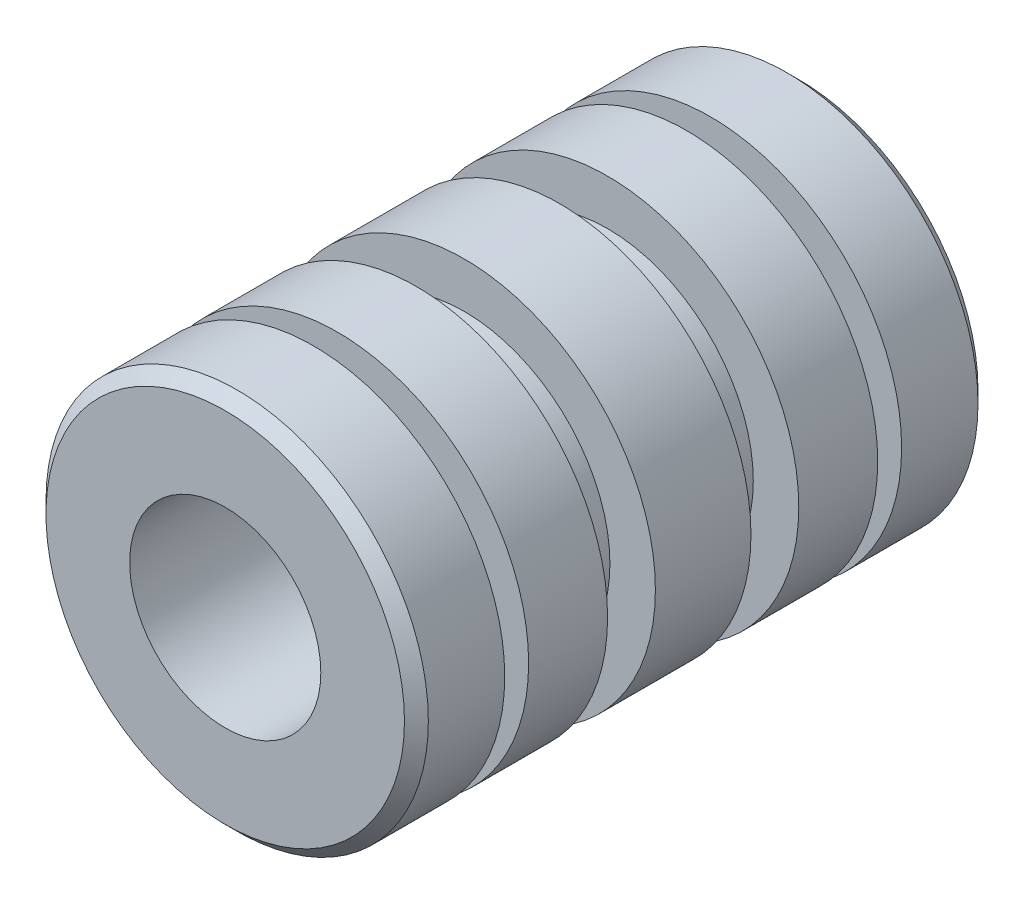
ISO-10303-21;
HEADER;
FILE_DESCRIPTION(('STEP AP214'),'2;1');
FILE_NAME('part.step','',(''),(''),'','','');
FILE_SCHEMA(('AUTOMOTIVE_DESIGN { 1 0 10303 214 1 1 1 1 }'));
ENDSEC;
DATA;
#1=APPLICATION_CONTEXT('core data for automotive mechanical design processes');
#2=APPLICATION_PROTOCOL_DEFINITION('international standard','automotive_design',2000,#1);
#3=PRODUCT_CONTEXT('',#1,'mechanical');
#4=PRODUCT('Part','Part','',(#3));
#5=PRODUCT_RELATED_PRODUCT_CATEGORY('part','',(#4));
#6=PRODUCT_DEFINITION_FORMATION('','',#4);
#7=PRODUCT_DEFINITION_CONTEXT('part definition',#1,'design');
#8=PRODUCT_DEFINITION('design','',#6,#7);
#9=PRODUCT_DEFINITION_SHAPE('','',#8);
#10=(LENGTH_UNIT() NAMED_UNIT(*) SI_UNIT(.MILLI.,.METRE.));
#11=(NAMED_UNIT(*) PLANE_ANGLE_UNIT() SI_UNIT($,.RADIAN.));
#12=(NAMED_UNIT(*) SI_UNIT($,.STERADIAN.) SOLID_ANGLE_UNIT());
#13=UNCERTAINTY_MEASURE_WITH_UNIT(LENGTH_MEASURE(1.E-05),#10,'distance_accuracy_value','');
#14=(GEOMETRIC_REPRESENTATION_CONTEXT(3) GLOBAL_UNCERTAINTY_ASSIGNED_CONTEXT((#13)) GLOBAL_UNIT_ASSIGNED_CONTEXT((#10,
#11,#12)) REPRESENTATION_CONTEXT('',''));
#15=CARTESIAN_POINT('',(0.,0.,0.));
#16=DIRECTION('',(0.,0.,1.));
#17=DIRECTION('',(1.,0.,0.));
#18=AXIS2_PLACEMENT_3D('',#15,#16,#17);
#19=CARTESIAN_POINT('',(0.,0.,19.05));
#20=DIRECTION('',(0.,0.,-1.));
#21=DIRECTION('',(-1.,0.,0.));
#22=AXIS2_PLACEMENT_3D('',#19,#20,#21);
#23=CYLINDRICAL_SURFACE('',#22,6.35);
#24=CARTESIAN_POINT('',(0.,0.,7.9375));
#25=DIRECTION('',(0.,0.,1.));
#26=DIRECTION('',(1.,0.,0.));
#27=AXIS2_PLACEMENT_3D('',#24,#25,#26);
#28=CIRCLE('',#27,6.35);
#29=CARTESIAN_POINT('',(6.35,0.,7.9375));
#30=VERTEX_POINT('',#29);
#31=EDGE_CURVE('E37',#30,#30,#28,.T.);
#32=ORIENTED_EDGE('',*,*,#31,.T.);
#33=EDGE_LOOP('',(#32));
#34=FACE_BOUND('',#33,.T.);
#35=CARTESIAN_POINT('',(0.,0.,11.1125));
#36=DIRECTION('',(0.,0.,-1.));
#37=DIRECTION('',(-1.,0.,0.));
#38=AXIS2_PLACEMENT_3D('',#35,#36,#37);
#39=CIRCLE('',#38,6.35);
#40=CARTESIAN_POINT('',(-6.35,0.,11.1125));
#41=VERTEX_POINT('',#40);
#42=EDGE_CURVE('E53',#41,#41,#39,.T.);
#43=ORIENTED_EDGE('',*,*,#42,.T.);
#44=EDGE_LOOP('',(#43));
#45=FACE_BOUND('',#44,.T.);
#46=ADVANCED_FACE('F33',(#34,#45),#23,.T.);
#47=CARTESIAN_POINT('',(0.,0.,6.35));
#48=DIRECTION('',(0.,0.,-1.));
#49=DIRECTION('',(-1.,0.,0.));
#50=AXIS2_PLACEMENT_3D('',#47,#48,#49);
#51=CIRCLE('',#50,6.35);
#52=CARTESIAN_POINT('',(-6.35,0.,6.35));
#53=VERTEX_POINT('',#52);
#54=EDGE_CURVE('E57',#53,#53,#51,.T.);
#55=ORIENTED_EDGE('',*,*,#54,.T.);
#56=EDGE_LOOP('',(#55));
#57=FACE_BOUND('',#56,.T.);
#58=CARTESIAN_POINT('',(0.,0.,3.72745));
#59=DIRECTION('',(0.,0.,1.));
#60=DIRECTION('',(1.,0.,0.));
#61=AXIS2_PLACEMENT_3D('',#58,#59,#60);
#62=CIRCLE('',#61,6.35);
#63=CARTESIAN_POINT('',(6.35,0.,3.72745));
#64=VERTEX_POINT('',#63);
#65=EDGE_CURVE('E86',#64,#64,#62,.T.);
#66=ORIENTED_EDGE('',*,*,#65,.T.);
#67=EDGE_LOOP('',(#66));
#68=FACE_BOUND('',#67,.T.);
#69=ADVANCED_FACE('F123',(#57,#68),#23,.T.);
#70=CARTESIAN_POINT('',(0.,0.,0.396875000000015));
#71=DIRECTION('',(0.,0.,1.));
#72=DIRECTION('',(1.,0.,0.));
#73=AXIS2_PLACEMENT_3D('',#70,#71,#72);
#74=CIRCLE('',#73,6.35);
#75=CARTESIAN_POINT('',(6.35,0.,0.396875000000015));
#76=VERTEX_POINT('',#75);
#77=EDGE_CURVE('E93',#76,#76,#74,.T.);
#78=ORIENTED_EDGE('',*,*,#77,.T.);
#79=EDGE_LOOP('',(#78));
#80=FACE_BOUND('',#79,.T.);
#81=CARTESIAN_POINT('',(0.,0.,2.9337));
#82=DIRECTION('',(0.,0.,1.));
#83=DIRECTION('',(1.,0.,0.));
#84=AXIS2_PLACEMENT_3D('',#81,#82,#83);
#85=CIRCLE('',#84,6.35);
#86=CARTESIAN_POINT('',(6.35,0.,2.9337));
#87=VERTEX_POINT('',#86);
#88=EDGE_CURVE('E81',#87,#87,#85,.T.);
#89=ORIENTED_EDGE('',*,*,#88,.F.);
#90=EDGE_LOOP('',(#89));
#91=FACE_BOUND('',#90,.T.);
#92=ADVANCED_FACE('F119',(#80,#91),#23,.T.);
#93=CARTESIAN_POINT('',(0.,0.,18.653125));
#94=DIRECTION('',(0.,0.,1.));
#95=DIRECTION('',(1.,0.,0.));
#96=AXIS2_PLACEMENT_3D('',#93,#94,#95);
#97=CIRCLE('',#96,6.35);
#98=CARTESIAN_POINT('',(6.35,0.,18.653125));
#99=VERTEX_POINT('',#98);
#100=EDGE_CURVE('E10',#99,#99,#97,.F.);
#101=ORIENTED_EDGE('',*,*,#100,.T.);
#102=EDGE_LOOP('',(#101));
#103=FACE_BOUND('',#102,.T.);
#104=CARTESIAN_POINT('',(0.,0.,16.1163));
#105=DIRECTION('',(0.,0.,-1.));
#106=DIRECTION('',(-1.,0.,0.));
#107=AXIS2_PLACEMENT_3D('',#104,#105,#106);
#108=CIRCLE('',#107,6.35);
#109=CARTESIAN_POINT('',(-6.35,0.,16.1163));
#110=VERTEX_POINT('',#109);
#111=EDGE_CURVE('E97',#110,#110,#108,.T.);
#112=ORIENTED_EDGE('',*,*,#111,.F.);
#113=EDGE_LOOP('',(#112));
#114=FACE_BOUND('',#113,.T.);
#115=ADVANCED_FACE('F122',(#103,#114),#23,.T.);
#116=CARTESIAN_POINT('',(0.,0.,12.7));
#117=DIRECTION('',(0.,0.,1.));
#118=DIRECTION('',(1.,0.,0.));
#119=AXIS2_PLACEMENT_3D('',#116,#117,#118);
#120=CIRCLE('',#119,6.35);
#121=CARTESIAN_POINT('',(6.35,0.,12.7));
#122=VERTEX_POINT('',#121);
#123=EDGE_CURVE('E50',#122,#122,#120,.T.);
#124=ORIENTED_EDGE('',*,*,#123,.T.);
#125=EDGE_LOOP('',(#124));
#126=FACE_BOUND('',#125,.T.);
#127=CARTESIAN_POINT('',(0.,0.,15.32255));
#128=DIRECTION('',(0.,0.,-1.));
#129=DIRECTION('',(-1.,0.,0.));
#130=AXIS2_PLACEMENT_3D('',#127,#128,#129);
#131=CIRCLE('',#130,6.35);
#132=CARTESIAN_POINT('',(-6.35,0.,15.32255));
#133=VERTEX_POINT('',#132);
#134=EDGE_CURVE('E89',#133,#133,#131,.T.);
#135=ORIENTED_EDGE('',*,*,#134,.T.);
#136=EDGE_LOOP('',(#135));
#137=FACE_BOUND('',#136,.T.);
#138=ADVANCED_FACE('F145',(#126,#137),#23,.T.);
#139=CARTESIAN_POINT('',(0.,0.,19.05));
#140=DIRECTION('',(0.,0.,1.));
#141=DIRECTION('',(1.,0.,0.));
#142=AXIS2_PLACEMENT_3D('',#139,#140,#141);
#143=PLANE('',#142);
#144=CARTESIAN_POINT('',(0.,0.,19.05));
#145=DIRECTION('',(0.,0.,1.));
#146=DIRECTION('',(1.,0.,0.));
#147=AXIS2_PLACEMENT_3D('',#144,#145,#146);
#148=CIRCLE('',#147,5.95312500000001);
#149=CARTESIAN_POINT('',(5.95312500000001,0.,19.05));
#150=VERTEX_POINT('',#149);
#151=EDGE_CURVE('E41',#150,#150,#148,.T.);
#152=ORIENTED_EDGE('',*,*,#151,.T.);
#153=EDGE_LOOP('',(#152));
#154=FACE_BOUND('',#153,.T.);
#155=CARTESIAN_POINT('',(0.,0.,19.05));
#156=DIRECTION('',(0.,0.,1.));
#157=DIRECTION('',(1.,0.,0.));
#158=AXIS2_PLACEMENT_3D('',#155,#156,#157);
#159=CIRCLE('',#158,3.175);
#160=CARTESIAN_POINT('',(3.175,0.,19.05));
#161=VERTEX_POINT('',#160);
#162=EDGE_CURVE('E94',#161,#161,#159,.T.);
#163=ORIENTED_EDGE('',*,*,#162,.F.);
#164=EDGE_LOOP('',(#163));
#165=FACE_BOUND('',#164,.T.);
#166=ADVANCED_FACE('F152',(#154,#165),#143,.T.);
#167=CARTESIAN_POINT('',(0.,0.,0.));
#168=DIRECTION('',(0.,0.,1.));
#169=DIRECTION('',(1.,0.,0.));
#170=AXIS2_PLACEMENT_3D('',#167,#168,#169);
#171=PLANE('',#170);
#172=CARTESIAN_POINT('',(0.,0.,0.));
#173=DIRECTION('',(0.,0.,1.));
#174=DIRECTION('',(1.,0.,0.));
#175=AXIS2_PLACEMENT_3D('',#172,#173,#174);
#176=CIRCLE('',#175,5.95312499999998);
#177=CARTESIAN_POINT('',(5.95312499999998,0.,0.));
#178=VERTEX_POINT('',#177);
#179=EDGE_CURVE('E46',#178,#178,#176,.F.);
#180=ORIENTED_EDGE('',*,*,#179,.T.);
#181=EDGE_LOOP('',(#180));
#182=FACE_BOUND('',#181,.T.);
#183=CARTESIAN_POINT('',(0.,0.,0.));
#184=DIRECTION('',(0.,0.,1.));
#185=DIRECTION('',(1.,0.,0.));
#186=AXIS2_PLACEMENT_3D('',#183,#184,#185);
#187=CIRCLE('',#186,3.175);
#188=CARTESIAN_POINT('',(3.175,0.,0.));
#189=VERTEX_POINT('',#188);
#190=EDGE_CURVE('E90',#189,#189,#187,.T.);
#191=ORIENTED_EDGE('',*,*,#190,.T.);
#192=EDGE_LOOP('',(#191));
#193=FACE_BOUND('',#192,.T.);
#194=ADVANCED_FACE('F110',(#182,#193),#171,.F.);
#195=CARTESIAN_POINT('',(0.,0.,0.));
#196=DIRECTION('',(0.,0.,1.));
#197=DIRECTION('',(1.,0.,0.));
#198=AXIS2_PLACEMENT_3D('',#195,#196,#197);
#199=CYLINDRICAL_SURFACE('',#198,3.175);
#200=ORIENTED_EDGE('',*,*,#190,.F.);
#201=EDGE_LOOP('',(#200));
#202=FACE_BOUND('',#201,.T.);
#203=ORIENTED_EDGE('',*,*,#162,.T.);
#204=EDGE_LOOP('',(#203));
#205=FACE_BOUND('',#204,.T.);
#206=ADVANCED_FACE('F174',(#202,#205),#199,.F.);
#207=CARTESIAN_POINT('',(7.91671964062443,0.,16.1163));
#208=DIRECTION('',(0.,0.,-1.));
#209=DIRECTION('',(-1.,0.,0.));
#210=AXIS2_PLACEMENT_3D('',#207,#208,#209);
#211=PLANE('',#210);
#212=CARTESIAN_POINT('',(0.,0.,16.1163));
#213=DIRECTION('',(0.,0.,1.));
#214=DIRECTION('',(1.,0.,0.));
#215=AXIS2_PLACEMENT_3D('',#212,#213,#214);
#216=CIRCLE('',#215,4.74171964062443);
#217=CARTESIAN_POINT('',(4.74171964062443,0.,16.1163));
#218=VERTEX_POINT('',#217);
#219=EDGE_CURVE('E85',#218,#218,#216,.T.);
#220=ORIENTED_EDGE('',*,*,#219,.T.);
#221=EDGE_LOOP('',(#220));
#222=FACE_BOUND('',#221,.T.);
#223=ORIENTED_EDGE('',*,*,#111,.T.);
#224=EDGE_LOOP('',(#223));
#225=FACE_BOUND('',#224,.T.);
#226=ADVANCED_FACE('F166',(#222,#225),#211,.T.);
#227=CARTESIAN_POINT('',(7.91671964062443,0.,15.32255));
#228=DIRECTION('',(0.,0.,-1.));
#229=DIRECTION('',(-1.,0.,0.));
#230=AXIS2_PLACEMENT_3D('',#227,#228,#229);
#231=PLANE('',#230);
#232=CARTESIAN_POINT('',(0.,0.,15.32255));
#233=DIRECTION('',(0.,0.,1.));
#234=DIRECTION('',(1.,0.,0.));
#235=AXIS2_PLACEMENT_3D('',#232,#233,#234);
#236=CIRCLE('',#235,4.74171964062443);
#237=CARTESIAN_POINT('',(4.74171964062443,0.,15.32255));
#238=VERTEX_POINT('',#237);
#239=EDGE_CURVE('E82',#238,#238,#236,.T.);
#240=ORIENTED_EDGE('',*,*,#239,.F.);
#241=EDGE_LOOP('',(#240));
#242=FACE_BOUND('',#241,.T.);
#243=ORIENTED_EDGE('',*,*,#134,.F.);
#244=EDGE_LOOP('',(#243));
#245=FACE_BOUND('',#244,.T.);
#246=ADVANCED_FACE('F164',(#242,#245),#231,.F.);
#247=CARTESIAN_POINT('',(0.,0.,19.05));
#248=DIRECTION('',(0.,0.,1.));
#249=DIRECTION('',(1.,0.,0.));
#250=AXIS2_PLACEMENT_3D('',#247,#248,#249);
#251=CYLINDRICAL_SURFACE('',#250,4.74171964062443);
#252=ORIENTED_EDGE('',*,*,#219,.F.);
#253=EDGE_LOOP('',(#252));
#254=FACE_BOUND('',#253,.T.);
#255=ORIENTED_EDGE('',*,*,#239,.T.);
#256=EDGE_LOOP('',(#255));
#257=FACE_BOUND('',#256,.T.);
#258=ADVANCED_FACE('F138',(#254,#257),#251,.T.);
#259=CARTESIAN_POINT('',(4.74171964062444,0.,3.72745));
#260=DIRECTION('',(0.,0.,1.));
#261=DIRECTION('',(1.,0.,0.));
#262=AXIS2_PLACEMENT_3D('',#259,#260,#261);
#263=PLANE('',#262);
#264=CARTESIAN_POINT('',(0.,0.,3.72745));
#265=DIRECTION('',(0.,0.,1.));
#266=DIRECTION('',(1.,0.,0.));
#267=AXIS2_PLACEMENT_3D('',#264,#265,#266);
#268=CIRCLE('',#267,4.74171964062444);
#269=CARTESIAN_POINT('',(4.74171964062444,0.,3.72745));
#270=VERTEX_POINT('',#269);
#271=EDGE_CURVE('E56',#270,#270,#268,.T.);
#272=ORIENTED_EDGE('',*,*,#271,.T.);
#273=EDGE_LOOP('',(#272));
#274=FACE_BOUND('',#273,.T.);
#275=ORIENTED_EDGE('',*,*,#65,.F.);
#276=EDGE_LOOP('',(#275));
#277=FACE_BOUND('',#276,.T.);
#278=ADVANCED_FACE('F129',(#274,#277),#263,.F.);
#279=CARTESIAN_POINT('',(4.74171964062444,0.,2.9337));
#280=DIRECTION('',(0.,0.,1.));
#281=DIRECTION('',(1.,0.,0.));
#282=AXIS2_PLACEMENT_3D('',#279,#280,#281);
#283=PLANE('',#282);
#284=CARTESIAN_POINT('',(0.,0.,2.9337));
#285=DIRECTION('',(0.,0.,1.));
#286=DIRECTION('',(1.,0.,0.));
#287=AXIS2_PLACEMENT_3D('',#284,#285,#286);
#288=CIRCLE('',#287,4.74171964062444);
#289=CARTESIAN_POINT('',(4.74171964062444,0.,2.9337));
#290=VERTEX_POINT('',#289);
#291=EDGE_CURVE('E78',#290,#290,#288,.T.);
#292=ORIENTED_EDGE('',*,*,#291,.F.);
#293=EDGE_LOOP('',(#292));
#294=FACE_BOUND('',#293,.T.);
#295=ORIENTED_EDGE('',*,*,#88,.T.);
#296=EDGE_LOOP('',(#295));
#297=FACE_BOUND('',#296,.T.);
#298=ADVANCED_FACE('F127',(#294,#297),#283,.T.);
#299=CARTESIAN_POINT('',(0.,0.,19.05));
#300=DIRECTION('',(0.,0.,1.));
#301=DIRECTION('',(1.,0.,0.));
#302=AXIS2_PLACEMENT_3D('',#299,#300,#301);
#303=CYLINDRICAL_SURFACE('',#302,4.74171964062444);
#304=ORIENTED_EDGE('',*,*,#271,.F.);
#305=EDGE_LOOP('',(#304));
#306=FACE_BOUND('',#305,.T.);
#307=ORIENTED_EDGE('',*,*,#291,.T.);
#308=EDGE_LOOP('',(#307));
#309=FACE_BOUND('',#308,.T.);
#310=ADVANCED_FACE('F116',(#306,#309),#303,.T.);
#311=CARTESIAN_POINT('',(0.,0.,0.396875000000015));
#312=DIRECTION('',(0.,0.,1.));
#313=DIRECTION('',(1.,0.,0.));
#314=AXIS2_PLACEMENT_3D('',#311,#312,#313);
#315=CONICAL_SURFACE('',#314,6.35,0.785398163397454);
#316=ORIENTED_EDGE('',*,*,#179,.F.);
#317=EDGE_LOOP('',(#316));
#318=FACE_BOUND('',#317,.T.);
#319=ORIENTED_EDGE('',*,*,#77,.F.);
#320=EDGE_LOOP('',(#319));
#321=FACE_BOUND('',#320,.T.);
#322=ADVANCED_FACE('F113',(#318,#321),#315,.T.);
#323=CARTESIAN_POINT('',(0.,0.,19.05));
#324=DIRECTION('',(0.,0.,-1.));
#325=DIRECTION('',(-1.,0.,0.));
#326=AXIS2_PLACEMENT_3D('',#323,#324,#325);
#327=CONICAL_SURFACE('',#326,5.95312500000001,0.785398163397447);
#328=ORIENTED_EDGE('',*,*,#100,.F.);
#329=EDGE_LOOP('',(#328));
#330=FACE_BOUND('',#329,.T.);
#331=ORIENTED_EDGE('',*,*,#151,.F.);
#332=EDGE_LOOP('',(#331));
#333=FACE_BOUND('',#332,.T.);
#334=ADVANCED_FACE('F35',(#330,#333),#327,.T.);
#335=CARTESIAN_POINT('',(4.83977433196498,0.,11.1125));
#336=DIRECTION('',(0.,0.,-1.));
#337=DIRECTION('',(-1.,0.,0.));
#338=AXIS2_PLACEMENT_3D('',#335,#336,#337);
#339=PLANE('',#338);
#340=CARTESIAN_POINT('',(0.,0.,11.1125));
#341=DIRECTION('',(0.,0.,1.));
#342=DIRECTION('',(1.,0.,0.));
#343=AXIS2_PLACEMENT_3D('',#340,#341,#342);
#344=CIRCLE('',#343,4.83977433196498);
#345=CARTESIAN_POINT('',(4.83977433196498,0.,11.1125));
#346=VERTEX_POINT('',#345);
#347=EDGE_CURVE('E54',#346,#346,#344,.T.);
#348=ORIENTED_EDGE('',*,*,#347,.F.);
#349=EDGE_LOOP('',(#348));
#350=FACE_BOUND('',#349,.T.);
#351=ORIENTED_EDGE('',*,*,#42,.F.);
#352=EDGE_LOOP('',(#351));
#353=FACE_BOUND('',#352,.T.);
#354=ADVANCED_FACE('F254',(#350,#353),#339,.F.);
#355=CARTESIAN_POINT('',(4.83977433196498,0.,12.7));
#356=DIRECTION('',(0.,0.,1.));
#357=DIRECTION('',(1.,0.,0.));
#358=AXIS2_PLACEMENT_3D('',#355,#356,#357);
#359=PLANE('',#358);
#360=CARTESIAN_POINT('',(0.,0.,12.7));
#361=DIRECTION('',(0.,0.,1.));
#362=DIRECTION('',(1.,0.,0.));
#363=AXIS2_PLACEMENT_3D('',#360,#361,#362);
#364=CIRCLE('',#363,4.83977433196498);
#365=CARTESIAN_POINT('',(4.83977433196498,0.,12.7));
#366=VERTEX_POINT('',#365);
#367=EDGE_CURVE('E63',#366,#366,#364,.T.);
#368=ORIENTED_EDGE('',*,*,#367,.T.);
#369=EDGE_LOOP('',(#368));
#370=FACE_BOUND('',#369,.T.);
#371=ORIENTED_EDGE('',*,*,#123,.F.);
#372=EDGE_LOOP('',(#371));
#373=FACE_BOUND('',#372,.T.);
#374=ADVANCED_FACE('F259',(#370,#373),#359,.F.);
#375=CARTESIAN_POINT('',(0.,0.,18.653125));
#376=DIRECTION('',(0.,0.,1.));
#377=DIRECTION('',(1.,0.,0.));
#378=AXIS2_PLACEMENT_3D('',#375,#376,#377);
#379=CYLINDRICAL_SURFACE('',#378,4.83977433196498);
#380=ORIENTED_EDGE('',*,*,#367,.F.);
#381=EDGE_LOOP('',(#380));
#382=FACE_BOUND('',#381,.T.);
#383=ORIENTED_EDGE('',*,*,#347,.T.);
#384=EDGE_LOOP('',(#383));
#385=FACE_BOUND('',#384,.T.);
#386=ADVANCED_FACE('F271',(#382,#385),#379,.T.);
#387=CARTESIAN_POINT('',(4.83977433196498,0.,7.9375));
#388=DIRECTION('',(0.,0.,1.));
#389=DIRECTION('',(1.,0.,0.));
#390=AXIS2_PLACEMENT_3D('',#387,#388,#389);
#391=PLANE('',#390);
#392=CARTESIAN_POINT('',(0.,0.,7.9375));
#393=DIRECTION('',(0.,0.,1.));
#394=DIRECTION('',(1.,0.,0.));
#395=AXIS2_PLACEMENT_3D('',#392,#393,#394);
#396=CIRCLE('',#395,4.83977433196498);
#397=CARTESIAN_POINT('',(4.83977433196498,0.,7.9375));
#398=VERTEX_POINT('',#397);
#399=EDGE_CURVE('E59',#398,#398,#396,.T.);
#400=ORIENTED_EDGE('',*,*,#399,.T.);
#401=EDGE_LOOP('',(#400));
#402=FACE_BOUND('',#401,.T.);
#403=ORIENTED_EDGE('',*,*,#31,.F.);
#404=EDGE_LOOP('',(#403));
#405=FACE_BOUND('',#404,.T.);
#406=ADVANCED_FACE('F281',(#402,#405),#391,.F.);
#407=CARTESIAN_POINT('',(4.83977433196498,0.,6.35));
#408=DIRECTION('',(0.,0.,-1.));
#409=DIRECTION('',(-1.,0.,0.));
#410=AXIS2_PLACEMENT_3D('',#407,#408,#409);
#411=PLANE('',#410);
#412=CARTESIAN_POINT('',(0.,0.,6.35));
#413=DIRECTION('',(0.,0.,1.));
#414=DIRECTION('',(1.,0.,0.));
#415=AXIS2_PLACEMENT_3D('',#412,#413,#414);
#416=CIRCLE('',#415,4.83977433196498);
#417=CARTESIAN_POINT('',(4.83977433196498,0.,6.35));
#418=VERTEX_POINT('',#417);
#419=EDGE_CURVE('E65',#418,#418,#416,.T.);
#420=ORIENTED_EDGE('',*,*,#419,.F.);
#421=EDGE_LOOP('',(#420));
#422=FACE_BOUND('',#421,.T.);
#423=ORIENTED_EDGE('',*,*,#54,.F.);
#424=EDGE_LOOP('',(#423));
#425=FACE_BOUND('',#424,.T.);
#426=ADVANCED_FACE('F291',(#422,#425),#411,.F.);
#427=CARTESIAN_POINT('',(0.,0.,18.653125));
#428=DIRECTION('',(0.,0.,1.));
#429=DIRECTION('',(1.,0.,0.));
#430=AXIS2_PLACEMENT_3D('',#427,#428,#429);
#431=CYLINDRICAL_SURFACE('',#430,4.83977433196498);
#432=ORIENTED_EDGE('',*,*,#399,.F.);
#433=EDGE_LOOP('',(#432));
#434=FACE_BOUND('',#433,.T.);
#435=ORIENTED_EDGE('',*,*,#419,.T.);
#436=EDGE_LOOP('',(#435));
#437=FACE_BOUND('',#436,.T.);
#438=ADVANCED_FACE('F300',(#434,#437),#431,.T.);
#439=CLOSED_SHELL('',(#46,#69,#92,#115,#138,#166,#194,#206,#226,#246,#258,#278,#298,#310,#322,
#334,#354,#374,#386,#406,#426,#438));
#440=MANIFOLD_SOLID_BREP('B2',#439);
#441=ADVANCED_BREP_SHAPE_REPRESENTATION('',(#18,#440),#14);
#442=SHAPE_DEFINITION_REPRESENTATION(#9,#441);
ENDSEC;
END-ISO-10303-21;
